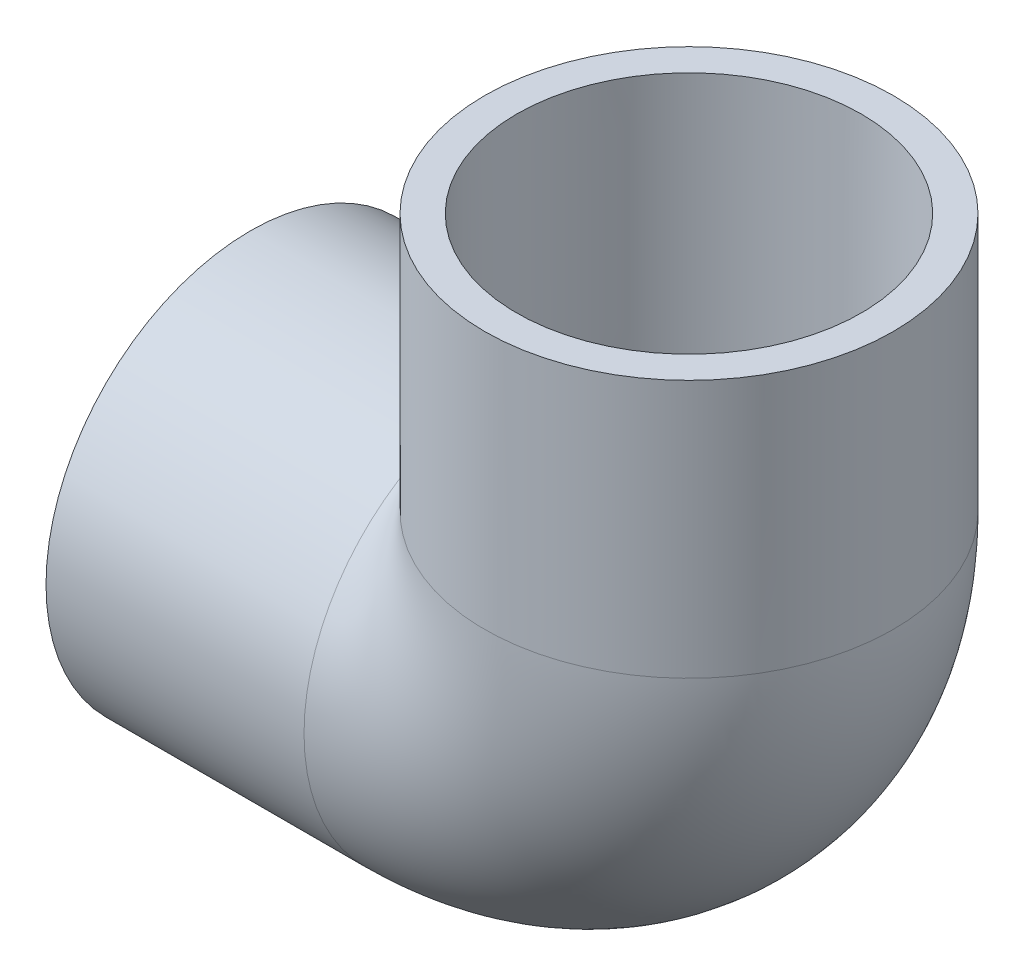
ISO-10303-21;
HEADER;
FILE_DESCRIPTION(('STEP AP214'),'2;1');
FILE_NAME('part.step','',(''),(''),'','','');
FILE_SCHEMA(('AUTOMOTIVE_DESIGN { 1 0 10303 214 1 1 1 1 }'));
ENDSEC;
DATA;
#1=APPLICATION_CONTEXT('core data for automotive mechanical design processes');
#2=APPLICATION_PROTOCOL_DEFINITION('international standard','automotive_design',2000,#1);
#3=PRODUCT_CONTEXT('',#1,'mechanical');
#4=PRODUCT('Part','Part','',(#3));
#5=PRODUCT_RELATED_PRODUCT_CATEGORY('part','',(#4));
#6=PRODUCT_DEFINITION_FORMATION('','',#4);
#7=PRODUCT_DEFINITION_CONTEXT('part definition',#1,'design');
#8=PRODUCT_DEFINITION('design','',#6,#7);
#9=PRODUCT_DEFINITION_SHAPE('','',#8);
#10=(LENGTH_UNIT() NAMED_UNIT(*) SI_UNIT(.MILLI.,.METRE.));
#11=(NAMED_UNIT(*) PLANE_ANGLE_UNIT() SI_UNIT($,.RADIAN.));
#12=(NAMED_UNIT(*) SI_UNIT($,.STERADIAN.) SOLID_ANGLE_UNIT());
#13=UNCERTAINTY_MEASURE_WITH_UNIT(LENGTH_MEASURE(1.E-05),#10,'distance_accuracy_value','');
#14=(GEOMETRIC_REPRESENTATION_CONTEXT(3) GLOBAL_UNCERTAINTY_ASSIGNED_CONTEXT((#13)) GLOBAL_UNIT_ASSIGNED_CONTEXT((#10,
#11,#12)) REPRESENTATION_CONTEXT('',''));
#15=CARTESIAN_POINT('',(0.,0.,0.));
#16=DIRECTION('',(0.,0.,1.));
#17=DIRECTION('',(1.,0.,0.));
#18=AXIS2_PLACEMENT_3D('',#15,#16,#17);
#19=CARTESIAN_POINT('',(-53.975,-25.146,0.));
#20=DIRECTION('',(-1.,0.,0.));
#21=DIRECTION('',(0.,0.,1.));
#22=AXIS2_PLACEMENT_3D('',#19,#20,#21);
#23=PLANE('',#22);
#24=CARTESIAN_POINT('',(-53.975,0.,0.));
#25=DIRECTION('',(-1.,0.,0.));
#26=DIRECTION('',(0.,0.,1.));
#27=AXIS2_PLACEMENT_3D('',#24,#25,#26);
#28=CIRCLE('',#27,25.146);
#29=CARTESIAN_POINT('',(-53.975,0.,25.146));
#30=VERTEX_POINT('',#29);
#31=EDGE_CURVE('E64',#30,#30,#28,.T.);
#32=ORIENTED_EDGE('',*,*,#31,.T.);
#33=EDGE_LOOP('',(#32));
#34=FACE_BOUND('',#33,.T.);
#35=CARTESIAN_POINT('',(-53.975,0.,0.));
#36=DIRECTION('',(-1.,0.,0.));
#37=DIRECTION('',(0.,0.,1.));
#38=AXIS2_PLACEMENT_3D('',#35,#36,#37);
#39=CIRCLE('',#38,21.209);
#40=CARTESIAN_POINT('',(-53.975,0.,21.209));
#41=VERTEX_POINT('',#40);
#42=EDGE_CURVE('E51',#41,#41,#39,.T.);
#43=ORIENTED_EDGE('',*,*,#42,.F.);
#44=EDGE_LOOP('',(#43));
#45=FACE_BOUND('',#44,.T.);
#46=ADVANCED_FACE('F44',(#34,#45),#23,.T.);
#47=CARTESIAN_POINT('',(-22.225,0.,0.));
#48=DIRECTION('',(-1.,0.,0.));
#49=DIRECTION('',(0.,0.,1.));
#50=AXIS2_PLACEMENT_3D('',#47,#48,#49);
#51=CONICAL_SURFACE('',#50,21.0185,0.00599992800155515);
#52=ORIENTED_EDGE('',*,*,#42,.T.);
#53=EDGE_LOOP('',(#52));
#54=FACE_BOUND('',#53,.T.);
#55=CARTESIAN_POINT('',(-22.225,0.,0.));
#56=DIRECTION('',(-1.,0.,0.));
#57=DIRECTION('',(0.,0.,1.));
#58=AXIS2_PLACEMENT_3D('',#55,#56,#57);
#59=CIRCLE('',#58,21.0185);
#60=CARTESIAN_POINT('',(-22.225,0.,21.0185));
#61=VERTEX_POINT('',#60);
#62=EDGE_CURVE('E75',#61,#61,#59,.T.);
#63=ORIENTED_EDGE('',*,*,#62,.F.);
#64=EDGE_LOOP('',(#63));
#65=FACE_BOUND('',#64,.T.);
#66=ADVANCED_FACE('F84',(#54,#65),#51,.F.);
#67=CARTESIAN_POINT('',(-53.975,0.,0.));
#68=DIRECTION('',(-1.,0.,0.));
#69=DIRECTION('',(0.,0.,1.));
#70=AXIS2_PLACEMENT_3D('',#67,#68,#69);
#71=CYLINDRICAL_SURFACE('',#70,25.146);
#72=CARTESIAN_POINT('',(0.,0.,0.));
#73=DIRECTION('',(-0.707106781186547,-0.707106781186547,0.));
#74=DIRECTION('',(-0.707106781186547,0.707106781186547,0.));
#75=AXIS2_PLACEMENT_3D('',#72,#73,#74);
#76=ELLIPSE('',#75,35.5618142394338,25.146);
#77=CARTESIAN_POINT('',(-22.225,22.225,-11.7631072000556));
#78=VERTEX_POINT('',#77);
#79=CARTESIAN_POINT('',(-22.225,22.225,11.7631072000556));
#80=VERTEX_POINT('',#79);
#81=EDGE_CURVE('E63',#78,#80,#76,.F.);
#82=ORIENTED_EDGE('',*,*,#81,.F.);
#83=CARTESIAN_POINT('',(-22.225,0.,0.));
#84=DIRECTION('',(-1.,0.,0.));
#85=DIRECTION('',(0.,0.,1.));
#86=AXIS2_PLACEMENT_3D('',#83,#84,#85);
#87=CIRCLE('',#86,25.146);
#88=EDGE_CURVE('E70',#78,#80,#87,.T.);
#89=ORIENTED_EDGE('',*,*,#88,.T.);
#90=EDGE_LOOP('',(#82,#89));
#91=FACE_BOUND('',#90,.T.);
#92=ORIENTED_EDGE('',*,*,#31,.F.);
#93=EDGE_LOOP('',(#92));
#94=FACE_BOUND('',#93,.T.);
#95=ADVANCED_FACE('F68',(#91,#94),#71,.T.);
#96=CARTESIAN_POINT('',(-22.225,22.225,0.));
#97=DIRECTION('',(0.,0.,-1.));
#98=DIRECTION('',(-1.,0.,0.));
#99=AXIS2_PLACEMENT_3D('',#96,#97,#98);
#100=TOROIDAL_SURFACE('',#99,22.225,17.526);
#101=CARTESIAN_POINT('',(0.,22.225,0.));
#102=DIRECTION('',(0.,1.,0.));
#103=DIRECTION('',(0.,0.,-1.));
#104=AXIS2_PLACEMENT_3D('',#101,#102,#103);
#105=CIRCLE('',#104,17.526);
#106=CARTESIAN_POINT('',(17.526,22.225,0.));
#107=VERTEX_POINT('',#106);
#108=EDGE_CURVE('E65',#107,#107,#105,.T.);
#109=CARTESIAN_POINT('',(-22.225,0.,0.));
#110=DIRECTION('',(1.,0.,0.));
#111=DIRECTION('',(0.,0.,-1.));
#112=AXIS2_PLACEMENT_3D('',#109,#110,#111);
#113=CIRCLE('',#112,17.526);
#114=CARTESIAN_POINT('',(-22.225,-17.526,0.));
#115=VERTEX_POINT('',#114);
#116=EDGE_CURVE('E71',#115,#115,#113,.T.);
#117=CARTESIAN_POINT('',(-22.225,22.225,0.));
#118=DIRECTION('',(0.,0.,-1.));
#119=DIRECTION('',(-1.,0.,0.));
#120=AXIS2_PLACEMENT_3D('',#117,#118,#119);
#121=CIRCLE('',#120,39.751);
#122=EDGE_CURVE('',#107,#115,#121,.T.);
#123=ORIENTED_EDGE('',*,*,#108,.T.);
#124=ORIENTED_EDGE('',*,*,#116,.F.);
#125=ORIENTED_EDGE('',*,*,#122,.T.);
#126=ORIENTED_EDGE('',*,*,#122,.F.);
#127=EDGE_LOOP('',(#123,#125,#124,#126));
#128=FACE_BOUND('',#127,.T.);
#129=ADVANCED_FACE('F94',(#128),#100,.F.);
#130=CARTESIAN_POINT('',(-44.45,22.225,0.));
#131=DIRECTION('',(0.,-1.,0.));
#132=DIRECTION('',(-1.,0.,0.));
#133=AXIS2_PLACEMENT_3D('',#130,#131,#132);
#134=CIRCLE('',#133,25.146);
#135=TRIMMED_CURVE('',#134,(PARAMETER_VALUE(-2.6548012951665)),
(PARAMETER_VALUE(2.6548012951665)),.T.,.PARAMETER.);
#136=CARTESIAN_POINT('',(-22.225,22.225,0.));
#137=DIRECTION('',(0.,0.,-1.));
#138=AXIS1_PLACEMENT('',#136,#137);
#139=SURFACE_OF_REVOLUTION('',#135,#138);
#140=CARTESIAN_POINT('',(0.,22.225,0.));
#141=DIRECTION('',(0.,1.,0.));
#142=DIRECTION('',(0.,0.,-1.));
#143=AXIS2_PLACEMENT_3D('',#140,#141,#142);
#144=CIRCLE('',#143,25.146);
#145=EDGE_CURVE('E57',#80,#78,#144,.T.);
#146=ORIENTED_EDGE('',*,*,#145,.F.);
#147=ORIENTED_EDGE('',*,*,#88,.F.);
#148=EDGE_LOOP('',(#146,#147));
#149=FACE_BOUND('',#148,.T.);
#150=ADVANCED_FACE('F74',(#149),#139,.T.);
#151=CARTESIAN_POINT('',(0.,22.225,0.));
#152=DIRECTION('',(0.,1.,0.));
#153=DIRECTION('',(0.,0.,-1.));
#154=AXIS2_PLACEMENT_3D('',#151,#152,#153);
#155=PLANE('',#154);
#156=CARTESIAN_POINT('',(0.,22.225,0.));
#157=DIRECTION('',(0.,1.,0.));
#158=DIRECTION('',(-1.,0.,0.));
#159=AXIS2_PLACEMENT_3D('',#156,#157,#158);
#160=CIRCLE('',#159,21.0185);
#161=CARTESIAN_POINT('',(-21.0185,22.225,0.));
#162=VERTEX_POINT('',#161);
#163=EDGE_CURVE('E13',#162,#162,#160,.F.);
#164=ORIENTED_EDGE('',*,*,#163,.F.);
#165=EDGE_LOOP('',(#164));
#166=FACE_BOUND('',#165,.T.);
#167=ORIENTED_EDGE('',*,*,#108,.F.);
#168=EDGE_LOOP('',(#167));
#169=FACE_BOUND('',#168,.T.);
#170=ADVANCED_FACE('F101',(#166,#169),#155,.T.);
#171=CARTESIAN_POINT('',(-22.225,0.,0.));
#172=DIRECTION('',(1.,0.,0.));
#173=DIRECTION('',(0.,0.,-1.));
#174=AXIS2_PLACEMENT_3D('',#171,#172,#173);
#175=PLANE('',#174);
#176=ORIENTED_EDGE('',*,*,#62,.T.);
#177=EDGE_LOOP('',(#176));
#178=FACE_BOUND('',#177,.T.);
#179=ORIENTED_EDGE('',*,*,#116,.T.);
#180=EDGE_LOOP('',(#179));
#181=FACE_BOUND('',#180,.T.);
#182=ADVANCED_FACE('F104',(#178,#181),#175,.F.);
#183=CARTESIAN_POINT('',(25.146,53.975,0.));
#184=DIRECTION('',(0.,1.,0.));
#185=DIRECTION('',(0.,0.,1.));
#186=AXIS2_PLACEMENT_3D('',#183,#184,#185);
#187=PLANE('',#186);
#188=CARTESIAN_POINT('',(0.,53.975,0.));
#189=DIRECTION('',(0.,-1.,0.));
#190=DIRECTION('',(0.,0.,-1.));
#191=AXIS2_PLACEMENT_3D('',#188,#189,#190);
#192=CIRCLE('',#191,21.209);
#193=CARTESIAN_POINT('',(0.,53.975,-21.209));
#194=VERTEX_POINT('',#193);
#195=EDGE_CURVE('E128',#194,#194,#192,.T.);
#196=ORIENTED_EDGE('',*,*,#195,.T.);
#197=EDGE_LOOP('',(#196));
#198=FACE_BOUND('',#197,.T.);
#199=CARTESIAN_POINT('',(0.,53.975,0.));
#200=DIRECTION('',(0.,-1.,0.));
#201=DIRECTION('',(0.,0.,-1.));
#202=AXIS2_PLACEMENT_3D('',#199,#200,#201);
#203=CIRCLE('',#202,25.146);
#204=CARTESIAN_POINT('',(0.,53.975,-25.146));
#205=VERTEX_POINT('',#204);
#206=EDGE_CURVE('E72',#205,#205,#203,.T.);
#207=ORIENTED_EDGE('',*,*,#206,.F.);
#208=EDGE_LOOP('',(#207));
#209=FACE_BOUND('',#208,.T.);
#210=ADVANCED_FACE('F111',(#198,#209),#187,.T.);
#211=CARTESIAN_POINT('',(0.,0.,0.));
#212=DIRECTION('',(0.,-1.,0.));
#213=DIRECTION('',(0.,0.,-1.));
#214=AXIS2_PLACEMENT_3D('',#211,#212,#213);
#215=CYLINDRICAL_SURFACE('',#214,25.146);
#216=ORIENTED_EDGE('',*,*,#206,.T.);
#217=EDGE_LOOP('',(#216));
#218=FACE_BOUND('',#217,.T.);
#219=ORIENTED_EDGE('',*,*,#145,.T.);
#220=ORIENTED_EDGE('',*,*,#81,.T.);
#221=EDGE_LOOP('',(#219,#220));
#222=FACE_BOUND('',#221,.T.);
#223=ADVANCED_FACE('F62',(#218,#222),#215,.T.);
#224=CARTESIAN_POINT('',(0.,53.975,0.));
#225=DIRECTION('',(0.,1.,0.));
#226=DIRECTION('',(0.,0.,1.));
#227=AXIS2_PLACEMENT_3D('',#224,#225,#226);
#228=CONICAL_SURFACE('',#227,21.209,0.00599992800155515);
#229=ORIENTED_EDGE('',*,*,#163,.T.);
#230=EDGE_LOOP('',(#229));
#231=FACE_BOUND('',#230,.T.);
#232=ORIENTED_EDGE('',*,*,#195,.F.);
#233=EDGE_LOOP('',(#232));
#234=FACE_BOUND('',#233,.T.);
#235=ADVANCED_FACE('F118',(#231,#234),#228,.F.);
#236=CLOSED_SHELL('',(#46,#66,#95,#129,#150,#170,#182,#210,#223,#235));
#237=MANIFOLD_SOLID_BREP('B2',#236);
#238=ADVANCED_BREP_SHAPE_REPRESENTATION('',(#18,#237),#14);
#239=SHAPE_DEFINITION_REPRESENTATION(#9,#238);
ENDSEC;
END-ISO-10303-21;
